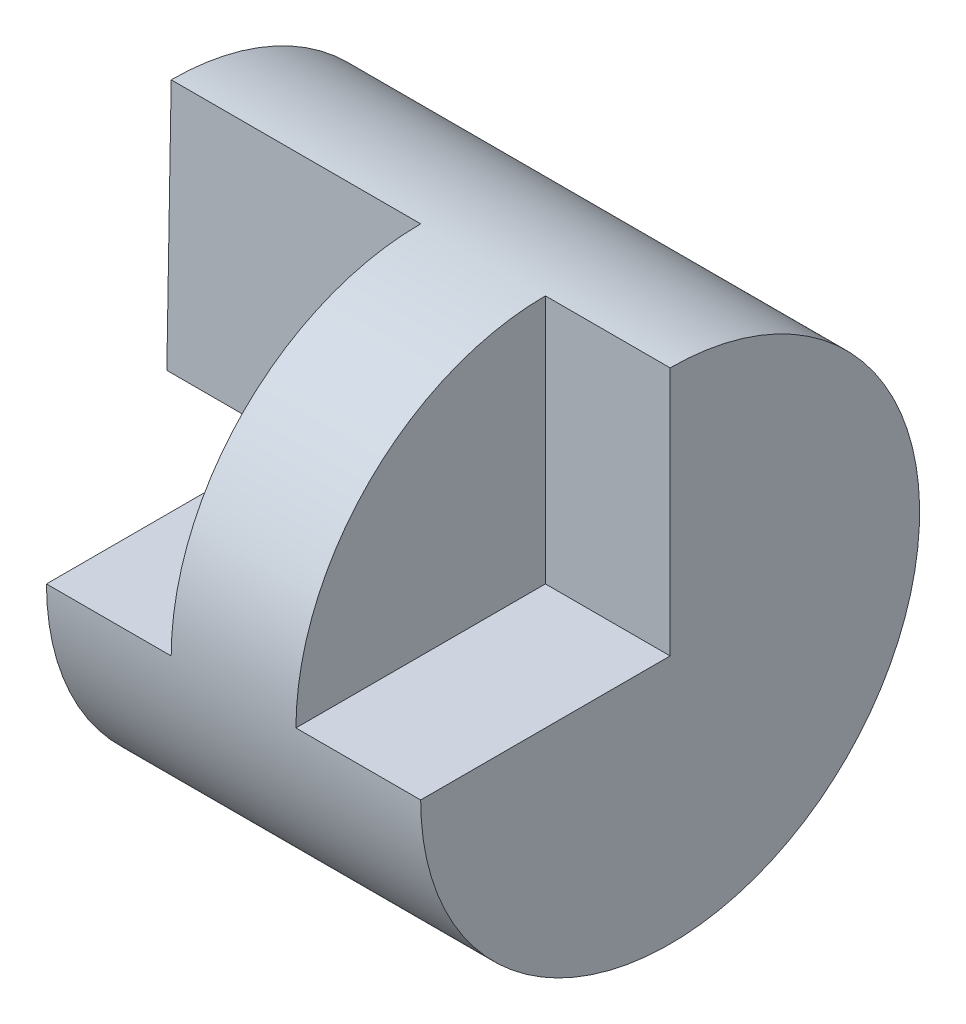
ISO-10303-21;
HEADER;
FILE_DESCRIPTION(('STEP AP214'),'2;1');
FILE_NAME('part.step','',(''),(''),'','','');
FILE_SCHEMA(('AUTOMOTIVE_DESIGN { 1 0 10303 214 1 1 1 1 }'));
ENDSEC;
DATA;
#1=APPLICATION_CONTEXT('core data for automotive mechanical design processes');
#2=APPLICATION_PROTOCOL_DEFINITION('international standard','automotive_design',2000,#1);
#3=PRODUCT_CONTEXT('',#1,'mechanical');
#4=PRODUCT('Part','Part','',(#3));
#5=PRODUCT_RELATED_PRODUCT_CATEGORY('part','',(#4));
#6=PRODUCT_DEFINITION_FORMATION('','',#4);
#7=PRODUCT_DEFINITION_CONTEXT('part definition',#1,'design');
#8=PRODUCT_DEFINITION('design','',#6,#7);
#9=PRODUCT_DEFINITION_SHAPE('','',#8);
#10=(LENGTH_UNIT() NAMED_UNIT(*) SI_UNIT(.MILLI.,.METRE.));
#11=(NAMED_UNIT(*) PLANE_ANGLE_UNIT() SI_UNIT($,.RADIAN.));
#12=(NAMED_UNIT(*) SI_UNIT($,.STERADIAN.) SOLID_ANGLE_UNIT());
#13=UNCERTAINTY_MEASURE_WITH_UNIT(LENGTH_MEASURE(1.E-05),#10,'distance_accuracy_value','');
#14=(GEOMETRIC_REPRESENTATION_CONTEXT(3) GLOBAL_UNCERTAINTY_ASSIGNED_CONTEXT((#13)) GLOBAL_UNIT_ASSIGNED_CONTEXT((#10,
#11,#12)) REPRESENTATION_CONTEXT('',''));
#15=CARTESIAN_POINT('',(0.,0.,0.));
#16=DIRECTION('',(0.,0.,1.));
#17=DIRECTION('',(1.,0.,0.));
#18=AXIS2_PLACEMENT_3D('',#15,#16,#17);
#19=CARTESIAN_POINT('',(0.,0.,0.));
#20=DIRECTION('',(-1.,0.,0.));
#21=DIRECTION('',(0.,0.,1.));
#22=AXIS2_PLACEMENT_3D('',#19,#20,#21);
#23=CYLINDRICAL_SURFACE('',#22,2.);
#24=DIRECTION('',(-1.,0.,0.));
#25=VECTOR('',#24,1.);
#26=CARTESIAN_POINT('',(0.,0.,-2.));
#27=LINE('',#26,#25);
#28=CARTESIAN_POINT('',(0.,0.,-2.));
#29=VERTEX_POINT('',#28);
#30=CARTESIAN_POINT('',(1.,0.,-2.));
#31=VERTEX_POINT('',#30);
#32=EDGE_CURVE('E133',#29,#31,#27,.F.);
#33=ORIENTED_EDGE('',*,*,#32,.F.);
#34=CARTESIAN_POINT('',(0.,0.,0.));
#35=DIRECTION('',(-1.,0.,0.));
#36=DIRECTION('',(0.,0.,1.));
#37=AXIS2_PLACEMENT_3D('',#34,#35,#36);
#38=CIRCLE('',#37,2.);
#39=CARTESIAN_POINT('',(0.,2.,0.));
#40=VERTEX_POINT('',#39);
#41=EDGE_CURVE('E110',#40,#29,#38,.T.);
#42=ORIENTED_EDGE('',*,*,#41,.F.);
#43=DIRECTION('',(1.,0.,0.));
#44=VECTOR('',#43,1.);
#45=CARTESIAN_POINT('',(0.5,2.,0.));
#46=LINE('',#45,#44);
#47=CARTESIAN_POINT('',(2.,2.,0.));
#48=VERTEX_POINT('',#47);
#49=EDGE_CURVE('E148',#40,#48,#46,.T.);
#50=ORIENTED_EDGE('',*,*,#49,.T.);
#51=CARTESIAN_POINT('',(2.,0.,0.));
#52=DIRECTION('',(1.,0.,0.));
#53=DIRECTION('',(0.,0.,-1.));
#54=AXIS2_PLACEMENT_3D('',#51,#52,#53);
#55=CIRCLE('',#54,2.);
#56=CARTESIAN_POINT('',(2.,0.,2.));
#57=VERTEX_POINT('',#56);
#58=EDGE_CURVE('E114',#57,#48,#55,.F.);
#59=ORIENTED_EDGE('',*,*,#58,.F.);
#60=DIRECTION('',(-1.,0.,0.));
#61=VECTOR('',#60,1.);
#62=CARTESIAN_POINT('',(0.,0.,2.));
#63=LINE('',#62,#61);
#64=CARTESIAN_POINT('',(1.,0.,2.));
#65=VERTEX_POINT('',#64);
#66=EDGE_CURVE('E111',#65,#57,#63,.F.);
#67=ORIENTED_EDGE('',*,*,#66,.F.);
#68=CARTESIAN_POINT('',(1.,0.,0.));
#69=DIRECTION('',(1.,0.,0.));
#70=DIRECTION('',(0.,0.,-1.));
#71=AXIS2_PLACEMENT_3D('',#68,#69,#70);
#72=CIRCLE('',#71,2.);
#73=EDGE_CURVE('E136',#31,#65,#72,.F.);
#74=ORIENTED_EDGE('',*,*,#73,.F.);
#75=EDGE_LOOP('',(#33,#42,#50,#59,#67,#74));
#76=FACE_BOUND('',#75,.T.);
#77=CARTESIAN_POINT('',(4.,0.,0.));
#78=DIRECTION('',(-1.,0.,0.));
#79=DIRECTION('',(0.,0.,1.));
#80=AXIS2_PLACEMENT_3D('',#77,#78,#79);
#81=CIRCLE('',#80,2.);
#82=CARTESIAN_POINT('',(4.,2.,0.));
#83=VERTEX_POINT('',#82);
#84=CARTESIAN_POINT('',(4.,0.,2.));
#85=VERTEX_POINT('',#84);
#86=EDGE_CURVE('E106',#83,#85,#81,.T.);
#87=ORIENTED_EDGE('',*,*,#86,.T.);
#88=DIRECTION('',(-1.,0.,0.));
#89=VECTOR('',#88,1.);
#90=CARTESIAN_POINT('',(0.,0.,2.));
#91=LINE('',#90,#89);
#92=CARTESIAN_POINT('',(3.,0.,2.));
#93=VERTEX_POINT('',#92);
#94=EDGE_CURVE('E124',#85,#93,#91,.T.);
#95=ORIENTED_EDGE('',*,*,#94,.T.);
#96=CARTESIAN_POINT('',(3.,0.,0.));
#97=DIRECTION('',(1.,0.,0.));
#98=DIRECTION('',(0.,0.,-1.));
#99=AXIS2_PLACEMENT_3D('',#96,#97,#98);
#100=CIRCLE('',#99,2.);
#101=CARTESIAN_POINT('',(3.,2.,0.));
#102=VERTEX_POINT('',#101);
#103=EDGE_CURVE('E11',#93,#102,#100,.F.);
#104=ORIENTED_EDGE('',*,*,#103,.T.);
#105=DIRECTION('',(-1.,0.,0.));
#106=VECTOR('',#105,1.);
#107=CARTESIAN_POINT('',(4.,2.,0.));
#108=LINE('',#107,#106);
#109=EDGE_CURVE('E97',#83,#102,#108,.T.);
#110=ORIENTED_EDGE('',*,*,#109,.F.);
#111=EDGE_LOOP('',(#87,#95,#104,#110));
#112=FACE_BOUND('',#111,.T.);
#113=ADVANCED_FACE('F33',(#76,#112),#23,.T.);
#114=CARTESIAN_POINT('',(4.,0.,0.));
#115=DIRECTION('',(-1.,0.,0.));
#116=DIRECTION('',(0.,0.,1.));
#117=AXIS2_PLACEMENT_3D('',#114,#115,#116);
#118=PLANE('',#117);
#119=DIRECTION('',(0.,0.,-1.));
#120=VECTOR('',#119,1.);
#121=CARTESIAN_POINT('',(4.,0.,0.));
#122=LINE('',#121,#120);
#123=CARTESIAN_POINT('',(4.,0.,0.));
#124=VERTEX_POINT('',#123);
#125=EDGE_CURVE('E40',#85,#124,#122,.T.);
#126=ORIENTED_EDGE('',*,*,#125,.F.);
#127=ORIENTED_EDGE('',*,*,#86,.F.);
#128=DIRECTION('',(0.,1.,0.));
#129=VECTOR('',#128,1.);
#130=CARTESIAN_POINT('',(4.,2.,0.));
#131=LINE('',#130,#129);
#132=EDGE_CURVE('E94',#124,#83,#131,.T.);
#133=ORIENTED_EDGE('',*,*,#132,.F.);
#134=EDGE_LOOP('',(#126,#127,#133));
#135=FACE_BOUND('',#134,.T.);
#136=ADVANCED_FACE('F109',(#135),#118,.F.);
#137=CARTESIAN_POINT('',(0.,-2.,0.));
#138=DIRECTION('',(1.,0.,0.));
#139=DIRECTION('',(0.,0.,-1.));
#140=AXIS2_PLACEMENT_3D('',#137,#138,#139);
#141=PLANE('',#140);
#142=ORIENTED_EDGE('',*,*,#41,.T.);
#143=DIRECTION('',(0.,0.,-1.));
#144=VECTOR('',#143,1.);
#145=CARTESIAN_POINT('',(0.,0.,2.));
#146=LINE('',#145,#144);
#147=CARTESIAN_POINT('',(0.,0.,0.034977088325542));
#148=VERTEX_POINT('',#147);
#149=EDGE_CURVE('E126',#148,#29,#146,.T.);
#150=ORIENTED_EDGE('',*,*,#149,.F.);
#151=DIRECTION('',(0.,-0.99984711048149,0.017485870347671));
#152=VECTOR('',#151,1.);
#153=CARTESIAN_POINT('',(0.,0.,0.0349770883255419));
#154=LINE('',#153,#152);
#155=EDGE_CURVE('E138',#40,#148,#154,.T.);
#156=ORIENTED_EDGE('',*,*,#155,.F.);
#157=EDGE_LOOP('',(#142,#150,#156));
#158=FACE_BOUND('',#157,.T.);
#159=ADVANCED_FACE('F168',(#158),#141,.F.);
#160=CARTESIAN_POINT('',(0.,0.,-11.));
#161=DIRECTION('',(0.,-1.,0.));
#162=DIRECTION('',(1.,0.,0.));
#163=AXIS2_PLACEMENT_3D('',#160,#161,#162);
#164=PLANE('',#163);
#165=DIRECTION('',(1.,0.,0.));
#166=VECTOR('',#165,1.);
#167=CARTESIAN_POINT('',(0.,0.,0.0349770883255419));
#168=LINE('',#167,#166);
#169=CARTESIAN_POINT('',(1.,0.,0.0349770883255419));
#170=VERTEX_POINT('',#169);
#171=CARTESIAN_POINT('',(2.,0.,0.0349770883255419));
#172=VERTEX_POINT('',#171);
#173=EDGE_CURVE('E141',#170,#172,#168,.T.);
#174=ORIENTED_EDGE('',*,*,#173,.F.);
#175=DIRECTION('',(0.,0.,-1.));
#176=VECTOR('',#175,1.);
#177=CARTESIAN_POINT('',(1.,0.,2.));
#178=LINE('',#177,#176);
#179=EDGE_CURVE('E55',#65,#170,#178,.T.);
#180=ORIENTED_EDGE('',*,*,#179,.F.);
#181=ORIENTED_EDGE('',*,*,#66,.T.);
#182=DIRECTION('',(0.,0.,-1.));
#183=VECTOR('',#182,1.);
#184=CARTESIAN_POINT('',(2.,0.,10.));
#185=LINE('',#184,#183);
#186=EDGE_CURVE('E116',#57,#172,#185,.T.);
#187=ORIENTED_EDGE('',*,*,#186,.T.);
#188=EDGE_LOOP('',(#174,#180,#181,#187));
#189=FACE_BOUND('',#188,.T.);
#190=ADVANCED_FACE('F154',(#189),#164,.F.);
#191=CARTESIAN_POINT('',(2.,0.,10.));
#192=DIRECTION('',(1.,0.,0.));
#193=DIRECTION('',(0.,0.,-1.));
#194=AXIS2_PLACEMENT_3D('',#191,#192,#193);
#195=PLANE('',#194);
#196=ORIENTED_EDGE('',*,*,#58,.T.);
#197=DIRECTION('',(0.,-0.99984711048149,0.017485870347671));
#198=VECTOR('',#197,1.);
#199=CARTESIAN_POINT('',(2.,-0.174220458090097,0.0380239505009088));
#200=LINE('',#199,#198);
#201=EDGE_CURVE('E145',#48,#172,#200,.T.);
#202=ORIENTED_EDGE('',*,*,#201,.T.);
#203=ORIENTED_EDGE('',*,*,#186,.F.);
#204=EDGE_LOOP('',(#196,#202,#203));
#205=FACE_BOUND('',#204,.T.);
#206=ADVANCED_FACE('F158',(#205),#195,.F.);
#207=CARTESIAN_POINT('',(0.,0.,0.0349770883255419));
#208=DIRECTION('',(0.,0.017485870347671,0.99984711048149));
#209=DIRECTION('',(0.,-0.99984711048149,0.017485870347671));
#210=AXIS2_PLACEMENT_3D('',#207,#208,#209);
#211=PLANE('',#210);
#212=ORIENTED_EDGE('',*,*,#201,.F.);
#213=ORIENTED_EDGE('',*,*,#49,.F.);
#214=ORIENTED_EDGE('',*,*,#155,.T.);
#215=EDGE_CURVE('E142',#148,#170,#168,.T.);
#216=ORIENTED_EDGE('',*,*,#215,.T.);
#217=ORIENTED_EDGE('',*,*,#173,.T.);
#218=EDGE_LOOP('',(#212,#213,#214,#216,#217));
#219=FACE_BOUND('',#218,.T.);
#220=ADVANCED_FACE('F165',(#219),#211,.T.);
#221=CARTESIAN_POINT('',(1.,0.,2.));
#222=DIRECTION('',(0.,1.,0.));
#223=DIRECTION('',(0.,0.,1.));
#224=AXIS2_PLACEMENT_3D('',#221,#222,#223);
#225=PLANE('',#224);
#226=ORIENTED_EDGE('',*,*,#32,.T.);
#227=EDGE_CURVE('E128',#170,#31,#178,.T.);
#228=ORIENTED_EDGE('',*,*,#227,.F.);
#229=ORIENTED_EDGE('',*,*,#215,.F.);
#230=ORIENTED_EDGE('',*,*,#149,.T.);
#231=EDGE_LOOP('',(#226,#228,#229,#230));
#232=FACE_BOUND('',#231,.T.);
#233=ADVANCED_FACE('F170',(#232),#225,.F.);
#234=CARTESIAN_POINT('',(1.,0.,0.));
#235=DIRECTION('',(1.,0.,0.));
#236=DIRECTION('',(0.,0.,-1.));
#237=AXIS2_PLACEMENT_3D('',#234,#235,#236);
#238=PLANE('',#237);
#239=ORIENTED_EDGE('',*,*,#73,.T.);
#240=ORIENTED_EDGE('',*,*,#179,.T.);
#241=ORIENTED_EDGE('',*,*,#227,.T.);
#242=EDGE_LOOP('',(#239,#240,#241));
#243=FACE_BOUND('',#242,.T.);
#244=ADVANCED_FACE('F171',(#243),#238,.F.);
#245=CARTESIAN_POINT('',(3.,2.,10.));
#246=DIRECTION('',(1.,0.,0.));
#247=DIRECTION('',(0.,0.,-1.));
#248=AXIS2_PLACEMENT_3D('',#245,#246,#247);
#249=PLANE('',#248);
#250=DIRECTION('',(0.,0.,-1.));
#251=VECTOR('',#250,1.);
#252=CARTESIAN_POINT('',(3.,0.,10.));
#253=LINE('',#252,#251);
#254=CARTESIAN_POINT('',(3.,0.,0.));
#255=VERTEX_POINT('',#254);
#256=EDGE_CURVE('E125',#93,#255,#253,.T.);
#257=ORIENTED_EDGE('',*,*,#256,.T.);
#258=DIRECTION('',(0.,-1.,0.));
#259=VECTOR('',#258,1.);
#260=CARTESIAN_POINT('',(3.,2.,0.));
#261=LINE('',#260,#259);
#262=EDGE_CURVE('E107',#102,#255,#261,.T.);
#263=ORIENTED_EDGE('',*,*,#262,.F.);
#264=ORIENTED_EDGE('',*,*,#103,.F.);
#265=EDGE_LOOP('',(#257,#263,#264));
#266=FACE_BOUND('',#265,.T.);
#267=ADVANCED_FACE('F173',(#266),#249,.T.);
#268=CARTESIAN_POINT('',(4.,0.,10.));
#269=DIRECTION('',(0.,1.,0.));
#270=DIRECTION('',(-1.,0.,0.));
#271=AXIS2_PLACEMENT_3D('',#268,#269,#270);
#272=PLANE('',#271);
#273=ORIENTED_EDGE('',*,*,#125,.T.);
#274=DIRECTION('',(1.,0.,0.));
#275=VECTOR('',#274,1.);
#276=CARTESIAN_POINT('',(4.,0.,0.));
#277=LINE('',#276,#275);
#278=EDGE_CURVE('E47',#255,#124,#277,.T.);
#279=ORIENTED_EDGE('',*,*,#278,.F.);
#280=ORIENTED_EDGE('',*,*,#256,.F.);
#281=ORIENTED_EDGE('',*,*,#94,.F.);
#282=EDGE_LOOP('',(#273,#279,#280,#281));
#283=FACE_BOUND('',#282,.T.);
#284=ADVANCED_FACE('F122',(#283),#272,.T.);
#285=CARTESIAN_POINT('',(0.,0.,0.));
#286=DIRECTION('',(0.,0.,-1.));
#287=DIRECTION('',(-1.,0.,0.));
#288=AXIS2_PLACEMENT_3D('',#285,#286,#287);
#289=PLANE('',#288);
#290=ORIENTED_EDGE('',*,*,#132,.T.);
#291=ORIENTED_EDGE('',*,*,#109,.T.);
#292=ORIENTED_EDGE('',*,*,#262,.T.);
#293=ORIENTED_EDGE('',*,*,#278,.T.);
#294=EDGE_LOOP('',(#290,#291,#292,#293));
#295=FACE_BOUND('',#294,.T.);
#296=ADVANCED_FACE('F96',(#295),#289,.F.);
#297=CLOSED_SHELL('',(#113,#136,#159,#190,#206,#220,#233,#244,#267,#284,#296));
#298=MANIFOLD_SOLID_BREP('B2',#297);
#299=ADVANCED_BREP_SHAPE_REPRESENTATION('',(#18,#298),#14);
#300=SHAPE_DEFINITION_REPRESENTATION(#9,#299);
ENDSEC;
END-ISO-10303-21;
